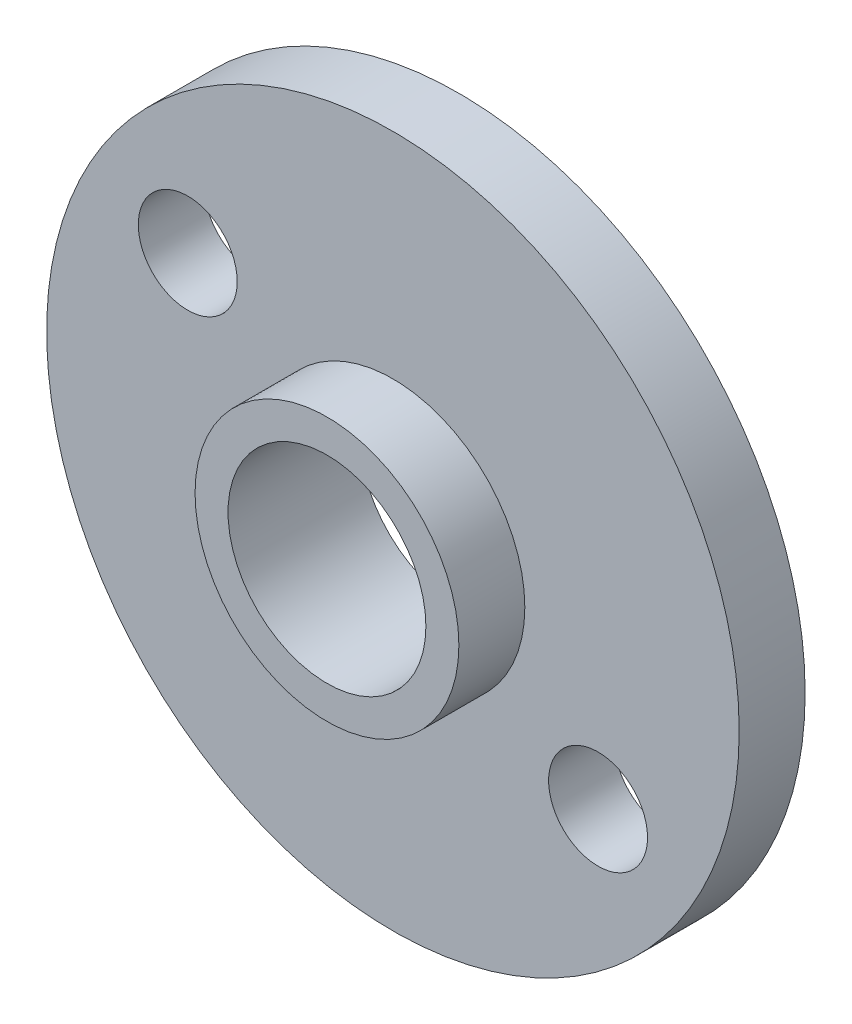
ISO-10303-21;
HEADER;
FILE_DESCRIPTION(('STEP AP214'),'2;1');
FILE_NAME('part.step','',(''),(''),'','','');
FILE_SCHEMA(('AUTOMOTIVE_DESIGN { 1 0 10303 214 1 1 1 1 }'));
ENDSEC;
DATA;
#1=APPLICATION_CONTEXT('core data for automotive mechanical design processes');
#2=APPLICATION_PROTOCOL_DEFINITION('international standard','automotive_design',2000,#1);
#3=PRODUCT_CONTEXT('',#1,'mechanical');
#4=PRODUCT('Part','Part','',(#3));
#5=PRODUCT_RELATED_PRODUCT_CATEGORY('part','',(#4));
#6=PRODUCT_DEFINITION_FORMATION('','',#4);
#7=PRODUCT_DEFINITION_CONTEXT('part definition',#1,'design');
#8=PRODUCT_DEFINITION('design','',#6,#7);
#9=PRODUCT_DEFINITION_SHAPE('','',#8);
#10=(LENGTH_UNIT() NAMED_UNIT(*) SI_UNIT(.MILLI.,.METRE.));
#11=(NAMED_UNIT(*) PLANE_ANGLE_UNIT() SI_UNIT($,.RADIAN.));
#12=(NAMED_UNIT(*) SI_UNIT($,.STERADIAN.) SOLID_ANGLE_UNIT());
#13=UNCERTAINTY_MEASURE_WITH_UNIT(LENGTH_MEASURE(1.E-05),#10,'distance_accuracy_value','');
#14=(GEOMETRIC_REPRESENTATION_CONTEXT(3) GLOBAL_UNCERTAINTY_ASSIGNED_CONTEXT((#13)) GLOBAL_UNIT_ASSIGNED_CONTEXT((#10,
#11,#12)) REPRESENTATION_CONTEXT('',''));
#15=CARTESIAN_POINT('',(0.,0.,0.));
#16=DIRECTION('',(0.,0.,1.));
#17=DIRECTION('',(1.,0.,0.));
#18=AXIS2_PLACEMENT_3D('',#15,#16,#17);
#19=CARTESIAN_POINT('',(0.,0.,2.));
#20=DIRECTION('',(0.,0.,1.));
#21=DIRECTION('',(1.,0.,0.));
#22=AXIS2_PLACEMENT_3D('',#19,#20,#21);
#23=PLANE('',#22);
#24=CARTESIAN_POINT('',(162.8,159.569296,2.));
#25=DIRECTION('',(0.,0.,1.));
#26=DIRECTION('',(1.,0.,0.));
#27=AXIS2_PLACEMENT_3D('',#24,#25,#26);
#28=CIRCLE('',#27,10.5);
#29=CARTESIAN_POINT('',(173.3,159.569296,2.));
#30=VERTEX_POINT('',#29);
#31=EDGE_CURVE('E10',#30,#30,#28,.T.);
#32=ORIENTED_EDGE('',*,*,#31,.T.);
#33=EDGE_LOOP('',(#32));
#34=FACE_BOUND('',#33,.T.);
#35=CARTESIAN_POINT('',(156.578976810171,163.758432658834,2.));
#36=DIRECTION('',(0.,0.,1.));
#37=DIRECTION('',(1.,0.,0.));
#38=AXIS2_PLACEMENT_3D('',#35,#36,#37);
#39=CIRCLE('',#38,1.5);
#40=CARTESIAN_POINT('',(158.078976810171,163.758432658834,2.));
#41=VERTEX_POINT('',#40);
#42=EDGE_CURVE('E55',#41,#41,#39,.T.);
#43=ORIENTED_EDGE('',*,*,#42,.F.);
#44=EDGE_LOOP('',(#43));
#45=FACE_BOUND('',#44,.T.);
#46=CARTESIAN_POINT('',(169.021023816284,155.380159191247,2.));
#47=DIRECTION('',(0.,0.,1.));
#48=DIRECTION('',(1.,0.,0.));
#49=AXIS2_PLACEMENT_3D('',#46,#47,#48);
#50=CIRCLE('',#49,1.5);
#51=CARTESIAN_POINT('',(170.521023816284,155.380159191247,2.));
#52=VERTEX_POINT('',#51);
#53=EDGE_CURVE('E63',#52,#52,#50,.T.);
#54=ORIENTED_EDGE('',*,*,#53,.F.);
#55=EDGE_LOOP('',(#54));
#56=FACE_BOUND('',#55,.T.);
#57=CARTESIAN_POINT('',(162.80000000001,159.569296000007,2.));
#58=DIRECTION('',(0.,0.,1.));
#59=DIRECTION('',(1.,0.,0.));
#60=AXIS2_PLACEMENT_3D('',#57,#58,#59);
#61=CIRCLE('',#60,4.00000030166503);
#62=CARTESIAN_POINT('',(166.800000301676,159.569296000007,2.));
#63=VERTEX_POINT('',#62);
#64=EDGE_CURVE('E69',#63,#63,#61,.T.);
#65=ORIENTED_EDGE('',*,*,#64,.F.);
#66=EDGE_LOOP('',(#65));
#67=FACE_BOUND('',#66,.T.);
#68=ADVANCED_FACE('F35',(#34,#45,#56,#67),#23,.T.);
#69=CARTESIAN_POINT('',(162.8,159.569296,2.));
#70=DIRECTION('',(0.,0.,-1.));
#71=DIRECTION('',(-1.,0.,0.));
#72=AXIS2_PLACEMENT_3D('',#69,#70,#71);
#73=CYLINDRICAL_SURFACE('',#72,3.);
#74=CARTESIAN_POINT('',(162.8,159.569296,0.));
#75=DIRECTION('',(0.,0.,1.));
#76=DIRECTION('',(1.,0.,0.));
#77=AXIS2_PLACEMENT_3D('',#74,#75,#76);
#78=CIRCLE('',#77,3.);
#79=CARTESIAN_POINT('',(165.8,159.569296,0.));
#80=VERTEX_POINT('',#79);
#81=EDGE_CURVE('E47',#80,#80,#78,.T.);
#82=ORIENTED_EDGE('',*,*,#81,.F.);
#83=EDGE_LOOP('',(#82));
#84=FACE_BOUND('',#83,.T.);
#85=CARTESIAN_POINT('',(162.80000000001,159.569296000007,4.));
#86=DIRECTION('',(0.,0.,1.));
#87=DIRECTION('',(1.,0.,0.));
#88=AXIS2_PLACEMENT_3D('',#85,#86,#87);
#89=CIRCLE('',#88,2.99999999998818);
#90=CARTESIAN_POINT('',(165.799999999999,159.569296000007,4.));
#91=VERTEX_POINT('',#90);
#92=EDGE_CURVE('E72',#91,#91,#89,.T.);
#93=ORIENTED_EDGE('',*,*,#92,.T.);
#94=EDGE_LOOP('',(#93));
#95=FACE_BOUND('',#94,.T.);
#96=ADVANCED_FACE('F37',(#84,#95),#73,.F.);
#97=CARTESIAN_POINT('',(162.8,159.569296,2.));
#98=DIRECTION('',(0.,0.,-1.));
#99=DIRECTION('',(-1.,0.,0.));
#100=AXIS2_PLACEMENT_3D('',#97,#98,#99);
#101=CYLINDRICAL_SURFACE('',#100,10.5);
#102=ORIENTED_EDGE('',*,*,#31,.F.);
#103=EDGE_LOOP('',(#102));
#104=FACE_BOUND('',#103,.T.);
#105=CARTESIAN_POINT('',(162.8,159.569296,0.));
#106=DIRECTION('',(0.,0.,1.));
#107=DIRECTION('',(1.,0.,0.));
#108=AXIS2_PLACEMENT_3D('',#105,#106,#107);
#109=CIRCLE('',#108,10.5);
#110=CARTESIAN_POINT('',(173.3,159.569296,0.));
#111=VERTEX_POINT('',#110);
#112=EDGE_CURVE('E39',#111,#111,#109,.T.);
#113=ORIENTED_EDGE('',*,*,#112,.T.);
#114=EDGE_LOOP('',(#113));
#115=FACE_BOUND('',#114,.T.);
#116=ADVANCED_FACE('F101',(#104,#115),#101,.T.);
#117=CARTESIAN_POINT('',(0.,0.,0.));
#118=DIRECTION('',(0.,0.,1.));
#119=DIRECTION('',(1.,0.,0.));
#120=AXIS2_PLACEMENT_3D('',#117,#118,#119);
#121=PLANE('',#120);
#122=CARTESIAN_POINT('',(169.021023816284,155.380159191247,0.));
#123=DIRECTION('',(0.,0.,1.));
#124=DIRECTION('',(1.,0.,0.));
#125=AXIS2_PLACEMENT_3D('',#122,#123,#124);
#126=CIRCLE('',#125,1.5);
#127=CARTESIAN_POINT('',(170.521023816284,155.380159191247,0.));
#128=VERTEX_POINT('',#127);
#129=EDGE_CURVE('E59',#128,#128,#126,.F.);
#130=ORIENTED_EDGE('',*,*,#129,.F.);
#131=EDGE_LOOP('',(#130));
#132=FACE_BOUND('',#131,.T.);
#133=CARTESIAN_POINT('',(156.578976810171,163.758432658834,0.));
#134=DIRECTION('',(0.,0.,1.));
#135=DIRECTION('',(1.,0.,0.));
#136=AXIS2_PLACEMENT_3D('',#133,#134,#135);
#137=CIRCLE('',#136,1.5);
#138=CARTESIAN_POINT('',(158.078976810171,163.758432658834,0.));
#139=VERTEX_POINT('',#138);
#140=EDGE_CURVE('E49',#139,#139,#137,.F.);
#141=ORIENTED_EDGE('',*,*,#140,.F.);
#142=EDGE_LOOP('',(#141));
#143=FACE_BOUND('',#142,.T.);
#144=ORIENTED_EDGE('',*,*,#81,.T.);
#145=EDGE_LOOP('',(#144));
#146=FACE_BOUND('',#145,.T.);
#147=ORIENTED_EDGE('',*,*,#112,.F.);
#148=EDGE_LOOP('',(#147));
#149=FACE_BOUND('',#148,.T.);
#150=ADVANCED_FACE('F106',(#132,#143,#146,#149),#121,.F.);
#151=CARTESIAN_POINT('',(156.578976810171,163.758432658834,-0.00100000000000013));
#152=DIRECTION('',(0.,0.,1.));
#153=DIRECTION('',(1.,0.,0.));
#154=AXIS2_PLACEMENT_3D('',#151,#152,#153);
#155=CYLINDRICAL_SURFACE('',#154,1.5);
#156=ORIENTED_EDGE('',*,*,#42,.T.);
#157=EDGE_LOOP('',(#156));
#158=FACE_BOUND('',#157,.T.);
#159=ORIENTED_EDGE('',*,*,#140,.T.);
#160=EDGE_LOOP('',(#159));
#161=FACE_BOUND('',#160,.T.);
#162=ADVANCED_FACE('F91',(#158,#161),#155,.F.);
#163=CARTESIAN_POINT('',(169.021023816284,155.380159191247,-0.00100000000000013));
#164=DIRECTION('',(0.,0.,1.));
#165=DIRECTION('',(1.,0.,0.));
#166=AXIS2_PLACEMENT_3D('',#163,#164,#165);
#167=CYLINDRICAL_SURFACE('',#166,1.5);
#168=ORIENTED_EDGE('',*,*,#53,.T.);
#169=EDGE_LOOP('',(#168));
#170=FACE_BOUND('',#169,.T.);
#171=ORIENTED_EDGE('',*,*,#129,.T.);
#172=EDGE_LOOP('',(#171));
#173=FACE_BOUND('',#172,.T.);
#174=ADVANCED_FACE('F82',(#170,#173),#167,.F.);
#175=CARTESIAN_POINT('',(162.80000000001,159.569296000007,4.));
#176=DIRECTION('',(0.,0.,1.));
#177=DIRECTION('',(1.,0.,0.));
#178=AXIS2_PLACEMENT_3D('',#175,#176,#177);
#179=PLANE('',#178);
#180=CARTESIAN_POINT('',(162.80000000001,159.569296000007,4.));
#181=DIRECTION('',(0.,0.,1.));
#182=DIRECTION('',(1.,0.,0.));
#183=AXIS2_PLACEMENT_3D('',#180,#181,#182);
#184=CIRCLE('',#183,4.00000030166503);
#185=CARTESIAN_POINT('',(166.800000301676,159.569296000007,4.));
#186=VERTEX_POINT('',#185);
#187=EDGE_CURVE('E68',#186,#186,#184,.T.);
#188=ORIENTED_EDGE('',*,*,#187,.T.);
#189=EDGE_LOOP('',(#188));
#190=FACE_BOUND('',#189,.T.);
#191=ORIENTED_EDGE('',*,*,#92,.F.);
#192=EDGE_LOOP('',(#191));
#193=FACE_BOUND('',#192,.T.);
#194=ADVANCED_FACE('F79',(#190,#193),#179,.T.);
#195=CARTESIAN_POINT('',(162.80000000001,159.569296000007,4.));
#196=DIRECTION('',(0.,0.,-1.));
#197=DIRECTION('',(-1.,0.,0.));
#198=AXIS2_PLACEMENT_3D('',#195,#196,#197);
#199=CYLINDRICAL_SURFACE('',#198,4.00000030166503);
#200=ORIENTED_EDGE('',*,*,#187,.F.);
#201=EDGE_LOOP('',(#200));
#202=FACE_BOUND('',#201,.T.);
#203=ORIENTED_EDGE('',*,*,#64,.T.);
#204=EDGE_LOOP('',(#203));
#205=FACE_BOUND('',#204,.T.);
#206=ADVANCED_FACE('F81',(#202,#205),#199,.T.);
#207=CLOSED_SHELL('',(#68,#96,#116,#150,#162,#174,#194,#206));
#208=MANIFOLD_SOLID_BREP('B2',#207);
#209=ADVANCED_BREP_SHAPE_REPRESENTATION('',(#18,#208),#14);
#210=SHAPE_DEFINITION_REPRESENTATION(#9,#209);
ENDSEC;
END-ISO-10303-21;
